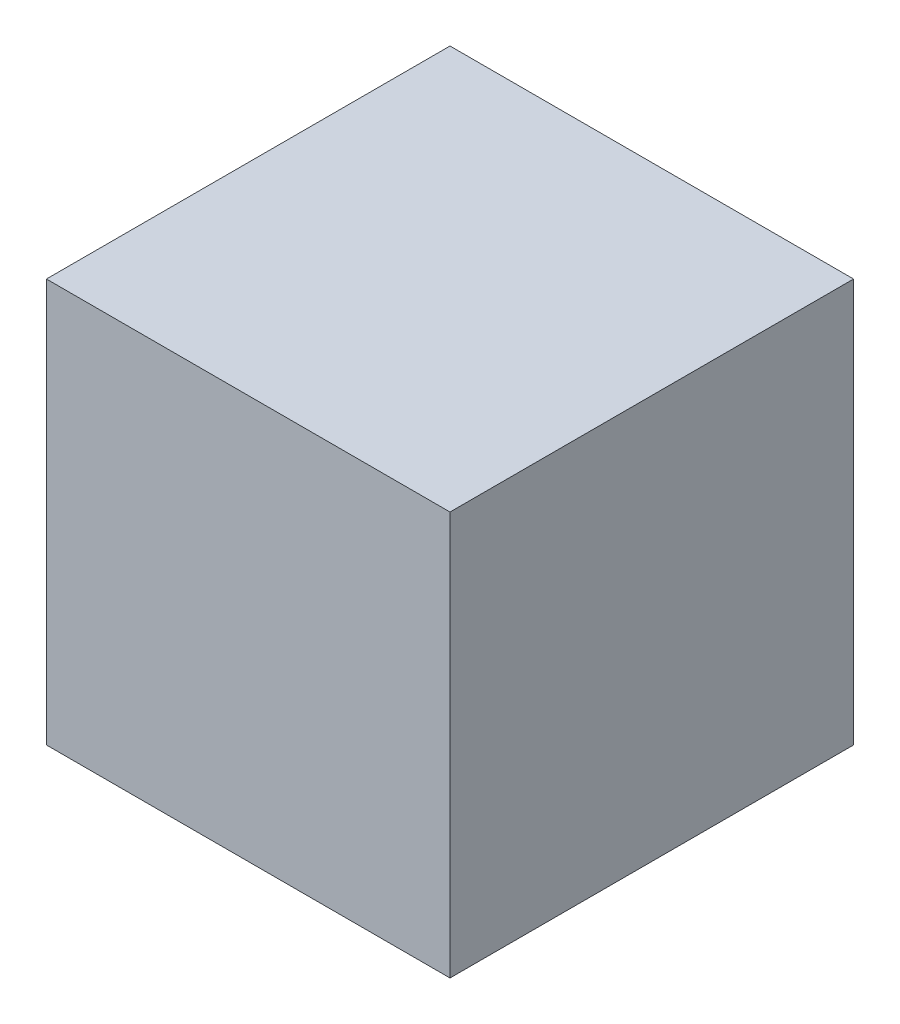
ISO-10303-21;
HEADER;
FILE_DESCRIPTION(('STEP AP214'),'2;1');
FILE_NAME('part.step','',(''),(''),'','','');
FILE_SCHEMA(('AUTOMOTIVE_DESIGN { 1 0 10303 214 1 1 1 1 }'));
ENDSEC;
DATA;
#1=APPLICATION_CONTEXT('core data for automotive mechanical design processes');
#2=APPLICATION_PROTOCOL_DEFINITION('international standard','automotive_design',2000,#1);
#3=PRODUCT_CONTEXT('',#1,'mechanical');
#4=PRODUCT('Part','Part','',(#3));
#5=PRODUCT_RELATED_PRODUCT_CATEGORY('part','',(#4));
#6=PRODUCT_DEFINITION_FORMATION('','',#4);
#7=PRODUCT_DEFINITION_CONTEXT('part definition',#1,'design');
#8=PRODUCT_DEFINITION('design','',#6,#7);
#9=PRODUCT_DEFINITION_SHAPE('','',#8);
#10=(LENGTH_UNIT() NAMED_UNIT(*) SI_UNIT(.MILLI.,.METRE.));
#11=(NAMED_UNIT(*) PLANE_ANGLE_UNIT() SI_UNIT($,.RADIAN.));
#12=(NAMED_UNIT(*) SI_UNIT($,.STERADIAN.) SOLID_ANGLE_UNIT());
#13=UNCERTAINTY_MEASURE_WITH_UNIT(LENGTH_MEASURE(1.E-05),#10,'distance_accuracy_value','');
#14=(GEOMETRIC_REPRESENTATION_CONTEXT(3) GLOBAL_UNCERTAINTY_ASSIGNED_CONTEXT((#13)) GLOBAL_UNIT_ASSIGNED_CONTEXT((#10,
#11,#12)) REPRESENTATION_CONTEXT('',''));
#15=CARTESIAN_POINT('',(0.,0.,0.));
#16=DIRECTION('',(0.,0.,1.));
#17=DIRECTION('',(1.,0.,0.));
#18=AXIS2_PLACEMENT_3D('',#15,#16,#17);
#19=CARTESIAN_POINT('',(40.,80.,40.));
#20=DIRECTION('',(-1.,0.,0.));
#21=DIRECTION('',(0.,0.,1.));
#22=AXIS2_PLACEMENT_3D('',#19,#20,#21);
#23=PLANE('',#22);
#24=DIRECTION('',(0.,0.,-1.));
#25=VECTOR('',#24,1.);
#26=CARTESIAN_POINT('',(40.,0.,40.));
#27=LINE('',#26,#25);
#28=CARTESIAN_POINT('',(40.,0.,40.));
#29=VERTEX_POINT('',#28);
#30=CARTESIAN_POINT('',(40.,0.,-40.));
#31=VERTEX_POINT('',#30);
#32=EDGE_CURVE('E104',#29,#31,#27,.T.);
#33=ORIENTED_EDGE('',*,*,#32,.T.);
#34=DIRECTION('',(0.,-1.,0.));
#35=VECTOR('',#34,1.);
#36=CARTESIAN_POINT('',(40.,80.,-40.));
#37=LINE('',#36,#35);
#38=CARTESIAN_POINT('',(40.,80.,-40.));
#39=VERTEX_POINT('',#38);
#40=EDGE_CURVE('E11',#39,#31,#37,.T.);
#41=ORIENTED_EDGE('',*,*,#40,.F.);
#42=DIRECTION('',(0.,0.,-1.));
#43=VECTOR('',#42,1.);
#44=CARTESIAN_POINT('',(40.,80.,40.));
#45=LINE('',#44,#43);
#46=CARTESIAN_POINT('',(40.,80.,40.));
#47=VERTEX_POINT('',#46);
#48=EDGE_CURVE('E92',#47,#39,#45,.T.);
#49=ORIENTED_EDGE('',*,*,#48,.F.);
#50=DIRECTION('',(0.,-1.,0.));
#51=VECTOR('',#50,1.);
#52=CARTESIAN_POINT('',(40.,80.,40.));
#53=LINE('',#52,#51);
#54=EDGE_CURVE('E100',#47,#29,#53,.T.);
#55=ORIENTED_EDGE('',*,*,#54,.T.);
#56=EDGE_LOOP('',(#33,#41,#49,#55));
#57=FACE_BOUND('',#56,.T.);
#58=ADVANCED_FACE('F41',(#57),#23,.F.);
#59=CARTESIAN_POINT('',(-40.,80.,-40.));
#60=DIRECTION('',(0.,0.,1.));
#61=DIRECTION('',(1.,0.,0.));
#62=AXIS2_PLACEMENT_3D('',#59,#60,#61);
#63=PLANE('',#62);
#64=DIRECTION('',(-1.,0.,0.));
#65=VECTOR('',#64,1.);
#66=CARTESIAN_POINT('',(-40.,0.,-40.));
#67=LINE('',#66,#65);
#68=CARTESIAN_POINT('',(-40.,0.,-40.));
#69=VERTEX_POINT('',#68);
#70=EDGE_CURVE('E96',#31,#69,#67,.T.);
#71=ORIENTED_EDGE('',*,*,#70,.T.);
#72=DIRECTION('',(0.,-1.,0.));
#73=VECTOR('',#72,1.);
#74=CARTESIAN_POINT('',(-40.,80.,-40.));
#75=LINE('',#74,#73);
#76=CARTESIAN_POINT('',(-40.,80.,-40.));
#77=VERTEX_POINT('',#76);
#78=EDGE_CURVE('E49',#77,#69,#75,.T.);
#79=ORIENTED_EDGE('',*,*,#78,.F.);
#80=DIRECTION('',(-1.,0.,0.));
#81=VECTOR('',#80,1.);
#82=CARTESIAN_POINT('',(-40.,80.,-40.));
#83=LINE('',#82,#81);
#84=EDGE_CURVE('E87',#39,#77,#83,.T.);
#85=ORIENTED_EDGE('',*,*,#84,.F.);
#86=ORIENTED_EDGE('',*,*,#40,.T.);
#87=EDGE_LOOP('',(#71,#79,#85,#86));
#88=FACE_BOUND('',#87,.T.);
#89=ADVANCED_FACE('F95',(#88),#63,.F.);
#90=CARTESIAN_POINT('',(-40.,80.,40.));
#91=DIRECTION('',(1.,0.,0.));
#92=DIRECTION('',(0.,0.,-1.));
#93=AXIS2_PLACEMENT_3D('',#90,#91,#92);
#94=PLANE('',#93);
#95=DIRECTION('',(0.,0.,1.));
#96=VECTOR('',#95,1.);
#97=CARTESIAN_POINT('',(-40.,0.,40.));
#98=LINE('',#97,#96);
#99=CARTESIAN_POINT('',(-40.,0.,40.));
#100=VERTEX_POINT('',#99);
#101=EDGE_CURVE('E74',#69,#100,#98,.T.);
#102=ORIENTED_EDGE('',*,*,#101,.T.);
#103=DIRECTION('',(0.,-1.,0.));
#104=VECTOR('',#103,1.);
#105=CARTESIAN_POINT('',(-40.,80.,40.));
#106=LINE('',#105,#104);
#107=CARTESIAN_POINT('',(-40.,80.,40.));
#108=VERTEX_POINT('',#107);
#109=EDGE_CURVE('E97',#108,#100,#106,.T.);
#110=ORIENTED_EDGE('',*,*,#109,.F.);
#111=DIRECTION('',(0.,0.,1.));
#112=VECTOR('',#111,1.);
#113=CARTESIAN_POINT('',(-40.,80.,40.));
#114=LINE('',#113,#112);
#115=EDGE_CURVE('E90',#77,#108,#114,.T.);
#116=ORIENTED_EDGE('',*,*,#115,.F.);
#117=ORIENTED_EDGE('',*,*,#78,.T.);
#118=EDGE_LOOP('',(#102,#110,#116,#117));
#119=FACE_BOUND('',#118,.T.);
#120=ADVANCED_FACE('F98',(#119),#94,.F.);
#121=CARTESIAN_POINT('',(-40.,80.,40.));
#122=DIRECTION('',(0.,0.,-1.));
#123=DIRECTION('',(-1.,0.,0.));
#124=AXIS2_PLACEMENT_3D('',#121,#122,#123);
#125=PLANE('',#124);
#126=DIRECTION('',(1.,0.,0.));
#127=VECTOR('',#126,1.);
#128=CARTESIAN_POINT('',(-40.,0.,40.));
#129=LINE('',#128,#127);
#130=EDGE_CURVE('E80',#100,#29,#129,.T.);
#131=ORIENTED_EDGE('',*,*,#130,.T.);
#132=ORIENTED_EDGE('',*,*,#54,.F.);
#133=DIRECTION('',(1.,0.,0.));
#134=VECTOR('',#133,1.);
#135=CARTESIAN_POINT('',(-40.,80.,40.));
#136=LINE('',#135,#134);
#137=EDGE_CURVE('E57',#108,#47,#136,.T.);
#138=ORIENTED_EDGE('',*,*,#137,.F.);
#139=ORIENTED_EDGE('',*,*,#109,.T.);
#140=EDGE_LOOP('',(#131,#132,#138,#139));
#141=FACE_BOUND('',#140,.T.);
#142=ADVANCED_FACE('F111',(#141),#125,.F.);
#143=CARTESIAN_POINT('',(0.,80.,0.));
#144=DIRECTION('',(0.,-1.,0.));
#145=DIRECTION('',(0.,0.,-1.));
#146=AXIS2_PLACEMENT_3D('',#143,#144,#145);
#147=PLANE('',#146);
#148=ORIENTED_EDGE('',*,*,#48,.T.);
#149=ORIENTED_EDGE('',*,*,#84,.T.);
#150=ORIENTED_EDGE('',*,*,#115,.T.);
#151=ORIENTED_EDGE('',*,*,#137,.T.);
#152=EDGE_LOOP('',(#148,#149,#150,#151));
#153=FACE_BOUND('',#152,.T.);
#154=ADVANCED_FACE('F88',(#153),#147,.F.);
#155=CARTESIAN_POINT('',(0.,0.,0.));
#156=DIRECTION('',(0.,-1.,0.));
#157=DIRECTION('',(0.,0.,-1.));
#158=AXIS2_PLACEMENT_3D('',#155,#156,#157);
#159=PLANE('',#158);
#160=ORIENTED_EDGE('',*,*,#32,.F.);
#161=ORIENTED_EDGE('',*,*,#130,.F.);
#162=ORIENTED_EDGE('',*,*,#101,.F.);
#163=ORIENTED_EDGE('',*,*,#70,.F.);
#164=EDGE_LOOP('',(#160,#161,#162,#163));
#165=FACE_BOUND('',#164,.T.);
#166=ADVANCED_FACE('F114',(#165),#159,.T.);
#167=CLOSED_SHELL('',(#58,#89,#120,#142,#154,#166));
#168=MANIFOLD_SOLID_BREP('B2',#167);
#169=ADVANCED_BREP_SHAPE_REPRESENTATION('',(#18,#168),#14);
#170=SHAPE_DEFINITION_REPRESENTATION(#9,#169);
ENDSEC;
END-ISO-10303-21;
